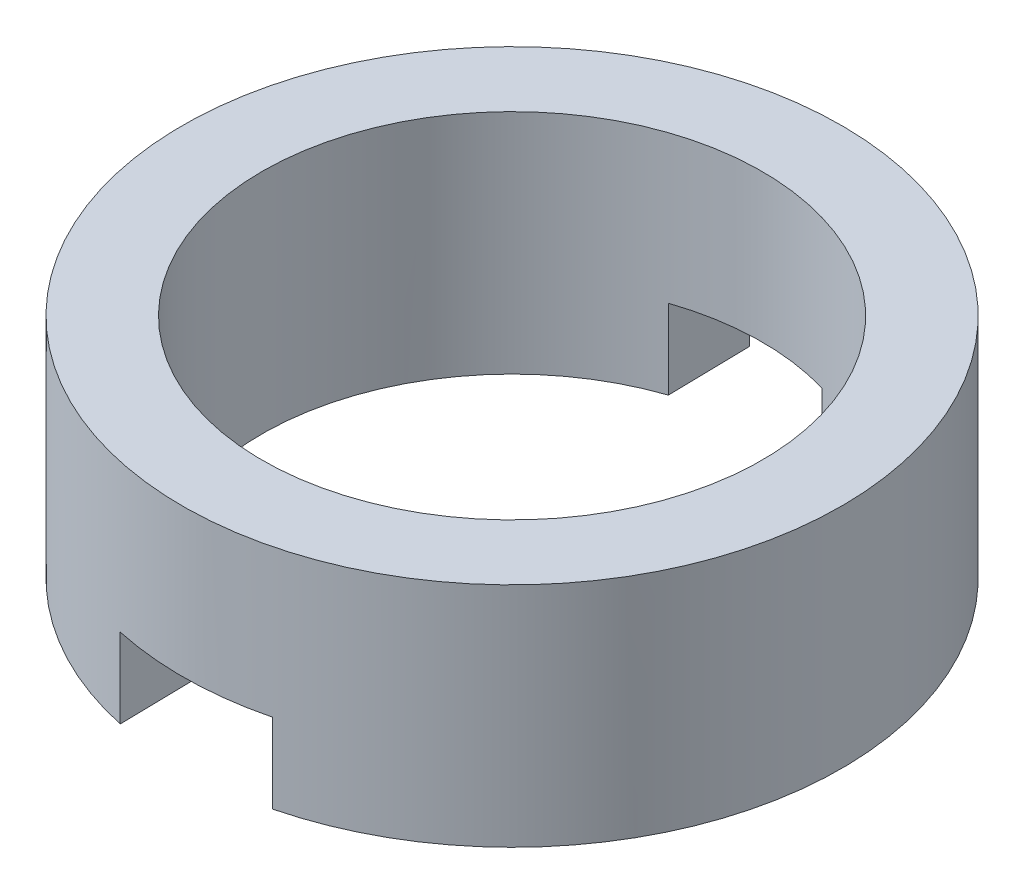
ISO-10303-21;
HEADER;
FILE_DESCRIPTION(('STEP AP214'),'2;1');
FILE_NAME('part.step','',(''),(''),'','','');
FILE_SCHEMA(('AUTOMOTIVE_DESIGN { 1 0 10303 214 1 1 1 1 }'));
ENDSEC;
DATA;
#1=APPLICATION_CONTEXT('core data for automotive mechanical design processes');
#2=APPLICATION_PROTOCOL_DEFINITION('international standard','automotive_design',2000,#1);
#3=PRODUCT_CONTEXT('',#1,'mechanical');
#4=PRODUCT('Part','Part','',(#3));
#5=PRODUCT_RELATED_PRODUCT_CATEGORY('part','',(#4));
#6=PRODUCT_DEFINITION_FORMATION('','',#4);
#7=PRODUCT_DEFINITION_CONTEXT('part definition',#1,'design');
#8=PRODUCT_DEFINITION('design','',#6,#7);
#9=PRODUCT_DEFINITION_SHAPE('','',#8);
#10=(LENGTH_UNIT() NAMED_UNIT(*) SI_UNIT(.MILLI.,.METRE.));
#11=(NAMED_UNIT(*) PLANE_ANGLE_UNIT() SI_UNIT($,.RADIAN.));
#12=(NAMED_UNIT(*) SI_UNIT($,.STERADIAN.) SOLID_ANGLE_UNIT());
#13=UNCERTAINTY_MEASURE_WITH_UNIT(LENGTH_MEASURE(1.E-05),#10,'distance_accuracy_value','');
#14=(GEOMETRIC_REPRESENTATION_CONTEXT(3) GLOBAL_UNCERTAINTY_ASSIGNED_CONTEXT((#13)) GLOBAL_UNIT_ASSIGNED_CONTEXT((#10,
#11,#12)) REPRESENTATION_CONTEXT('',''));
#15=CARTESIAN_POINT('',(0.,0.,0.));
#16=DIRECTION('',(0.,0.,1.));
#17=DIRECTION('',(1.,0.,0.));
#18=AXIS2_PLACEMENT_3D('',#15,#16,#17);
#19=CARTESIAN_POINT('',(0.316333204636976,-0.332509734718711,0.491066496124404));
#20=DIRECTION('',(0.,1.,0.));
#21=DIRECTION('',(-0.97397093294504,0.,0.226672940110148));
#22=AXIS2_PLACEMENT_3D('',#19,#20,#21);
#23=PLANE('',#22);
#24=CARTESIAN_POINT('',(0.316333204636976,-0.332509734718711,0.491066496124404));
#25=DIRECTION('',(0.,1.,0.));
#26=DIRECTION('',(-0.97397093294504,0.,0.226672940110148));
#27=AXIS2_PLACEMENT_3D('',#24,#25,#26);
#28=CIRCLE('',#27,7.25);
#29=CARTESIAN_POINT('',(2.08301630968859,-0.332509734718711,7.5225194616454));
#30=VERTEX_POINT('',#29);
#31=CARTESIAN_POINT('',(1.81147691106259,-0.332509734718711,-6.60308921806283));
#32=VERTEX_POINT('',#31);
#33=EDGE_CURVE('E104',#30,#32,#28,.T.);
#34=ORIENTED_EDGE('',*,*,#33,.F.);
#35=DIRECTION('',(0.0192196490440647,0.,0.99981528548559));
#36=VECTOR('',#35,1.);
#37=CARTESIAN_POINT('',(1.76085659651934,-0.332509734718711,-9.23638205917459));
#38=LINE('',#37,#36);
#39=CARTESIAN_POINT('',(2.04819851643008,-0.332509734718711,5.71128129456029));
#40=VERTEX_POINT('',#39);
#41=EDGE_CURVE('E98',#40,#30,#38,.T.);
#42=ORIENTED_EDGE('',*,*,#41,.F.);
#43=CARTESIAN_POINT('',(0.316333204636976,-0.332509734718711,0.491066496124404));
#44=DIRECTION('',(0.,1.,0.));
#45=DIRECTION('',(-0.97397093294504,0.,0.226672940110148));
#46=AXIS2_PLACEMENT_3D('',#43,#44,#45);
#47=CIRCLE('',#46,5.5);
#48=CARTESIAN_POINT('',(1.84629470432075,-0.332509734718711,-4.79185105097873));
#49=VERTEX_POINT('',#48);
#50=EDGE_CURVE('E110',#40,#49,#47,.T.);
#51=ORIENTED_EDGE('',*,*,#50,.T.);
#52=EDGE_CURVE('E143',#32,#49,#38,.T.);
#53=ORIENTED_EDGE('',*,*,#52,.F.);
#54=EDGE_LOOP('',(#34,#42,#51,#53));
#55=FACE_BOUND('',#54,.T.);
#56=ADVANCED_FACE('F16',(#55),#23,.F.);
#57=CARTESIAN_POINT('',(0.316333204636976,4.66749026528118,0.491066496124404));
#58=DIRECTION('',(0.,1.,0.));
#59=DIRECTION('',(-0.97397093294504,0.,0.226672940110148));
#60=AXIS2_PLACEMENT_3D('',#57,#58,#59);
#61=PLANE('',#60);
#62=CARTESIAN_POINT('',(0.316333204636976,4.66749026528118,0.491066496124404));
#63=DIRECTION('',(0.,1.,0.));
#64=DIRECTION('',(-0.97397093294504,0.,0.226672940110148));
#65=AXIS2_PLACEMENT_3D('',#62,#63,#64);
#66=CIRCLE('',#65,7.25);
#67=CARTESIAN_POINT('',(-6.74495605921456,4.66749026528118,2.13444531192297));
#68=VERTEX_POINT('',#67);
#69=EDGE_CURVE('E108',#68,#68,#66,.T.);
#70=ORIENTED_EDGE('',*,*,#69,.T.);
#71=EDGE_LOOP('',(#70));
#72=FACE_BOUND('',#71,.T.);
#73=CARTESIAN_POINT('',(0.316333204636976,4.66749026528118,0.491066496124404));
#74=DIRECTION('',(0.,1.,0.));
#75=DIRECTION('',(-0.97397093294504,0.,0.226672940110148));
#76=AXIS2_PLACEMENT_3D('',#73,#74,#75);
#77=CIRCLE('',#76,5.5);
#78=CARTESIAN_POINT('',(-5.04050692656074,4.66749026528118,1.73776766673022));
#79=VERTEX_POINT('',#78);
#80=EDGE_CURVE('E105',#79,#79,#77,.T.);
#81=ORIENTED_EDGE('',*,*,#80,.F.);
#82=EDGE_LOOP('',(#81));
#83=FACE_BOUND('',#82,.T.);
#84=ADVANCED_FACE('F174',(#72,#83),#61,.T.);
#85=CARTESIAN_POINT('',(-1.48774476316136,-0.332509734718711,-6.53088499089846));
#86=VERTEX_POINT('',#85);
#87=CARTESIAN_POINT('',(-1.21654290029243,-0.332509734718711,7.57716491817163));
#88=VERTEX_POINT('',#87);
#89=EDGE_CURVE('E95',#86,#88,#28,.T.);
#90=ORIENTED_EDGE('',*,*,#89,.F.);
#91=DIRECTION('',(-0.0192196490440647,0.,-0.99981528548559));
#92=VECTOR('',#91,1.);
#93=CARTESIAN_POINT('',(-1.53853384558317,-0.332509734718711,-9.17295721732902));
#94=LINE('',#93,#92);
#95=CARTESIAN_POINT('',(-1.45286864838294,-0.332509734718711,-4.71661291060409));
#96=VERTEX_POINT('',#95);
#97=EDGE_CURVE('E99',#96,#86,#94,.T.);
#98=ORIENTED_EDGE('',*,*,#97,.F.);
#99=CARTESIAN_POINT('',(-1.25141901507079,-0.332509734718711,5.76289283787748));
#100=VERTEX_POINT('',#99);
#101=EDGE_CURVE('E97',#96,#100,#47,.T.);
#102=ORIENTED_EDGE('',*,*,#101,.T.);
#103=EDGE_CURVE('E82',#88,#100,#94,.T.);
#104=ORIENTED_EDGE('',*,*,#103,.F.);
#105=EDGE_LOOP('',(#90,#98,#102,#104));
#106=FACE_BOUND('',#105,.T.);
#107=ADVANCED_FACE('F93',(#106),#23,.F.);
#108=CARTESIAN_POINT('',(0.316333204636976,4.66749026528118,0.491066496124404));
#109=DIRECTION('',(0.,-1.,0.));
#110=DIRECTION('',(0.97397093294504,0.,-0.226672940110148));
#111=AXIS2_PLACEMENT_3D('',#108,#109,#110);
#112=CYLINDRICAL_SURFACE('',#111,7.25);
#113=CARTESIAN_POINT('',(0.316333204636976,1.41749026528121,0.491066496124404));
#114=DIRECTION('',(0.,-1.,0.));
#115=DIRECTION('',(0.97397093294504,0.,-0.226672940110148));
#116=AXIS2_PLACEMENT_3D('',#113,#114,#115);
#117=CIRCLE('',#116,7.25);
#118=CARTESIAN_POINT('',(2.08301630968859,1.41749026528121,7.5225194616454));
#119=VERTEX_POINT('',#118);
#120=CARTESIAN_POINT('',(-1.21654290029243,1.41749026528121,7.57716491817163));
#121=VERTEX_POINT('',#120);
#122=EDGE_CURVE('E88',#119,#121,#117,.T.);
#123=ORIENTED_EDGE('',*,*,#122,.F.);
#124=DIRECTION('',(0.,-1.,0.));
#125=VECTOR('',#124,1.);
#126=CARTESIAN_POINT('',(2.08301630968859,4.66749026528118,7.5225194616454));
#127=LINE('',#126,#125);
#128=EDGE_CURVE('E136',#119,#30,#127,.T.);
#129=ORIENTED_EDGE('',*,*,#128,.T.);
#130=ORIENTED_EDGE('',*,*,#33,.T.);
#131=DIRECTION('',(0.,-1.,0.));
#132=VECTOR('',#131,1.);
#133=CARTESIAN_POINT('',(1.81147691106259,4.66749026528118,-6.60308921806283));
#134=LINE('',#133,#132);
#135=CARTESIAN_POINT('',(1.81147691106259,1.41749026528121,-6.60308921806283));
#136=VERTEX_POINT('',#135);
#137=EDGE_CURVE('E146',#32,#136,#134,.F.);
#138=ORIENTED_EDGE('',*,*,#137,.T.);
#139=CARTESIAN_POINT('',(-1.48774476316136,1.41749026528121,-6.53088499089846));
#140=VERTEX_POINT('',#139);
#141=EDGE_CURVE('E138',#140,#136,#117,.T.);
#142=ORIENTED_EDGE('',*,*,#141,.F.);
#143=DIRECTION('',(0.,-1.,0.));
#144=VECTOR('',#143,1.);
#145=CARTESIAN_POINT('',(-1.48774476316136,4.66749026528118,-6.53088499089846));
#146=LINE('',#145,#144);
#147=EDGE_CURVE('E87',#140,#86,#146,.T.);
#148=ORIENTED_EDGE('',*,*,#147,.T.);
#149=ORIENTED_EDGE('',*,*,#89,.T.);
#150=DIRECTION('',(0.,-1.,0.));
#151=VECTOR('',#150,1.);
#152=CARTESIAN_POINT('',(-1.21654290029243,4.66749026528118,7.57716491817163));
#153=LINE('',#152,#151);
#154=EDGE_CURVE('E79',#88,#121,#153,.F.);
#155=ORIENTED_EDGE('',*,*,#154,.T.);
#156=EDGE_LOOP('',(#123,#129,#130,#138,#142,#148,#149,#155));
#157=FACE_BOUND('',#156,.T.);
#158=ORIENTED_EDGE('',*,*,#69,.F.);
#159=EDGE_LOOP('',(#158));
#160=FACE_BOUND('',#159,.T.);
#161=ADVANCED_FACE('F18',(#157,#160),#112,.T.);
#162=CARTESIAN_POINT('',(0.316333204636976,4.66749026528118,0.491066496124404));
#163=DIRECTION('',(0.,-1.,0.));
#164=DIRECTION('',(0.97397093294504,0.,-0.226672940110148));
#165=AXIS2_PLACEMENT_3D('',#162,#163,#164);
#166=CYLINDRICAL_SURFACE('',#165,5.5);
#167=DIRECTION('',(0.,-1.,0.));
#168=VECTOR('',#167,1.);
#169=CARTESIAN_POINT('',(2.04819851643008,4.66749026528118,5.71128129456029));
#170=LINE('',#169,#168);
#171=CARTESIAN_POINT('',(2.04819851643008,1.41749026528121,5.71128129456029));
#172=VERTEX_POINT('',#171);
#173=EDGE_CURVE('E11',#172,#40,#170,.T.);
#174=ORIENTED_EDGE('',*,*,#173,.F.);
#175=CARTESIAN_POINT('',(0.316333204636976,1.41749026528121,0.491066496124404));
#176=DIRECTION('',(0.,-1.,0.));
#177=DIRECTION('',(0.97397093294504,0.,-0.226672940110148));
#178=AXIS2_PLACEMENT_3D('',#175,#176,#177);
#179=CIRCLE('',#178,5.5);
#180=CARTESIAN_POINT('',(-1.25141901507079,1.41749026528121,5.76289283787748));
#181=VERTEX_POINT('',#180);
#182=EDGE_CURVE('E119',#172,#181,#179,.T.);
#183=ORIENTED_EDGE('',*,*,#182,.T.);
#184=DIRECTION('',(0.,-1.,0.));
#185=VECTOR('',#184,1.);
#186=CARTESIAN_POINT('',(-1.25141901507079,4.66749026528118,5.76289283787748));
#187=LINE('',#186,#185);
#188=EDGE_CURVE('E24',#100,#181,#187,.F.);
#189=ORIENTED_EDGE('',*,*,#188,.F.);
#190=ORIENTED_EDGE('',*,*,#101,.F.);
#191=DIRECTION('',(0.,-1.,0.));
#192=VECTOR('',#191,1.);
#193=CARTESIAN_POINT('',(-1.45286864838294,4.66749026528118,-4.71661291060409));
#194=LINE('',#193,#192);
#195=CARTESIAN_POINT('',(-1.45286864838294,1.41749026528121,-4.71661291060409));
#196=VERTEX_POINT('',#195);
#197=EDGE_CURVE('E118',#196,#96,#194,.T.);
#198=ORIENTED_EDGE('',*,*,#197,.F.);
#199=CARTESIAN_POINT('',(1.84629470432075,1.41749026528121,-4.79185105097873));
#200=VERTEX_POINT('',#199);
#201=EDGE_CURVE('E115',#196,#200,#179,.T.);
#202=ORIENTED_EDGE('',*,*,#201,.T.);
#203=DIRECTION('',(0.,-1.,0.));
#204=VECTOR('',#203,1.);
#205=CARTESIAN_POINT('',(1.84629470432075,4.66749026528118,-4.79185105097873));
#206=LINE('',#205,#204);
#207=EDGE_CURVE('E121',#49,#200,#206,.F.);
#208=ORIENTED_EDGE('',*,*,#207,.F.);
#209=ORIENTED_EDGE('',*,*,#50,.F.);
#210=EDGE_LOOP('',(#174,#183,#189,#190,#198,#202,#208,#209));
#211=FACE_BOUND('',#210,.T.);
#212=ORIENTED_EDGE('',*,*,#80,.T.);
#213=EDGE_LOOP('',(#212));
#214=FACE_BOUND('',#213,.T.);
#215=ADVANCED_FACE('F125',(#211,#214),#166,.F.);
#216=CARTESIAN_POINT('',(2.11244974645639,1.41749026528121,9.05366084292334));
#217=DIRECTION('',(0.,-1.,0.));
#218=DIRECTION('',(0.97397093294504,0.,-0.226672940110148));
#219=AXIS2_PLACEMENT_3D('',#216,#217,#218);
#220=PLANE('',#219);
#221=ORIENTED_EDGE('',*,*,#141,.T.);
#222=DIRECTION('',(0.0192196490440647,0.,0.99981528548559));
#223=VECTOR('',#222,1.);
#224=CARTESIAN_POINT('',(1.76085659651934,1.41749026528121,-9.23638205917459));
#225=LINE('',#224,#223);
#226=EDGE_CURVE('E39',#136,#200,#225,.T.);
#227=ORIENTED_EDGE('',*,*,#226,.T.);
#228=ORIENTED_EDGE('',*,*,#201,.F.);
#229=DIRECTION('',(-0.0192196490440647,0.,-0.99981528548559));
#230=VECTOR('',#229,1.);
#231=CARTESIAN_POINT('',(-1.53853384558317,1.41749026528121,-9.17295721732902));
#232=LINE('',#231,#230);
#233=EDGE_CURVE('E139',#196,#140,#232,.T.);
#234=ORIENTED_EDGE('',*,*,#233,.T.);
#235=EDGE_LOOP('',(#221,#227,#228,#234));
#236=FACE_BOUND('',#235,.T.);
#237=ADVANCED_FACE('F159',(#236),#220,.T.);
#238=CARTESIAN_POINT('',(-1.53853384558317,1.41749026528121,-9.17295721732902));
#239=DIRECTION('',(-0.99981528548559,0.,0.0192196490440647));
#240=DIRECTION('',(0.0192196490440648,0.,0.99981528548559));
#241=AXIS2_PLACEMENT_3D('',#238,#239,#240);
#242=PLANE('',#241);
#243=ORIENTED_EDGE('',*,*,#233,.F.);
#244=ORIENTED_EDGE('',*,*,#197,.T.);
#245=ORIENTED_EDGE('',*,*,#97,.T.);
#246=ORIENTED_EDGE('',*,*,#147,.F.);
#247=EDGE_LOOP('',(#243,#244,#245,#246));
#248=FACE_BOUND('',#247,.T.);
#249=ADVANCED_FACE('F161',(#248),#242,.F.);
#250=CARTESIAN_POINT('',(1.76085659651934,1.41749026528121,-9.23638205917459));
#251=DIRECTION('',(0.99981528548559,0.,-0.0192196490440647));
#252=DIRECTION('',(-0.0192196490440648,0.,-0.99981528548559));
#253=AXIS2_PLACEMENT_3D('',#250,#251,#252);
#254=PLANE('',#253);
#255=ORIENTED_EDGE('',*,*,#52,.T.);
#256=ORIENTED_EDGE('',*,*,#207,.T.);
#257=ORIENTED_EDGE('',*,*,#226,.F.);
#258=ORIENTED_EDGE('',*,*,#137,.F.);
#259=EDGE_LOOP('',(#255,#256,#257,#258));
#260=FACE_BOUND('',#259,.T.);
#261=ADVANCED_FACE('F156',(#260),#254,.F.);
#262=EDGE_CURVE('E131',#172,#119,#225,.T.);
#263=ORIENTED_EDGE('',*,*,#262,.F.);
#264=ORIENTED_EDGE('',*,*,#173,.T.);
#265=ORIENTED_EDGE('',*,*,#41,.T.);
#266=ORIENTED_EDGE('',*,*,#128,.F.);
#267=EDGE_LOOP('',(#263,#264,#265,#266));
#268=FACE_BOUND('',#267,.T.);
#269=ADVANCED_FACE('F133',(#268),#254,.F.);
#270=ORIENTED_EDGE('',*,*,#103,.T.);
#271=ORIENTED_EDGE('',*,*,#188,.T.);
#272=EDGE_CURVE('E31',#121,#181,#232,.T.);
#273=ORIENTED_EDGE('',*,*,#272,.F.);
#274=ORIENTED_EDGE('',*,*,#154,.F.);
#275=EDGE_LOOP('',(#270,#271,#273,#274));
#276=FACE_BOUND('',#275,.T.);
#277=ADVANCED_FACE('F81',(#276),#242,.F.);
#278=ORIENTED_EDGE('',*,*,#122,.T.);
#279=ORIENTED_EDGE('',*,*,#272,.T.);
#280=ORIENTED_EDGE('',*,*,#182,.F.);
#281=ORIENTED_EDGE('',*,*,#262,.T.);
#282=EDGE_LOOP('',(#278,#279,#280,#281));
#283=FACE_BOUND('',#282,.T.);
#284=ADVANCED_FACE('F130',(#283),#220,.T.);
#285=CLOSED_SHELL('',(#56,#84,#107,#161,#215,#237,#249,#261,#269,#277,#284));
#286=MANIFOLD_SOLID_BREP('B1',#285);
#287=ADVANCED_BREP_SHAPE_REPRESENTATION('',(#18,#286),#14);
#288=SHAPE_DEFINITION_REPRESENTATION(#9,#287);
ENDSEC;
END-ISO-10303-21;
